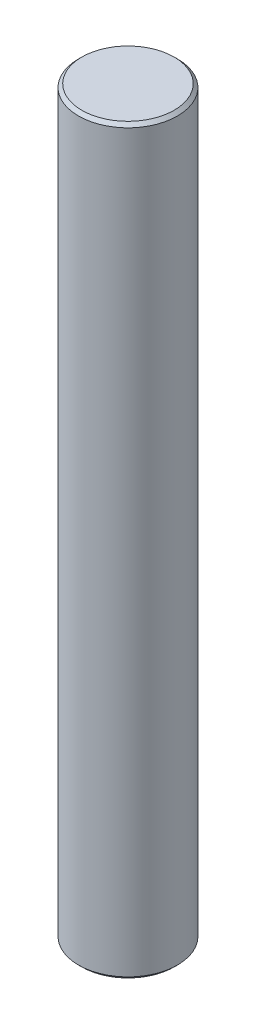
ISO-10303-21;
HEADER;
FILE_DESCRIPTION(('STEP AP214'),'2;1');
FILE_NAME('part.step','',(''),(''),'','','');
FILE_SCHEMA(('AUTOMOTIVE_DESIGN { 1 0 10303 214 1 1 1 1 }'));
ENDSEC;
DATA;
#1=APPLICATION_CONTEXT('core data for automotive mechanical design processes');
#2=APPLICATION_PROTOCOL_DEFINITION('international standard','automotive_design',2000,#1);
#3=PRODUCT_CONTEXT('',#1,'mechanical');
#4=PRODUCT('Part','Part','',(#3));
#5=PRODUCT_RELATED_PRODUCT_CATEGORY('part','',(#4));
#6=PRODUCT_DEFINITION_FORMATION('','',#4);
#7=PRODUCT_DEFINITION_CONTEXT('part definition',#1,'design');
#8=PRODUCT_DEFINITION('design','',#6,#7);
#9=PRODUCT_DEFINITION_SHAPE('','',#8);
#10=(LENGTH_UNIT() NAMED_UNIT(*) SI_UNIT(.MILLI.,.METRE.));
#11=(NAMED_UNIT(*) PLANE_ANGLE_UNIT() SI_UNIT($,.RADIAN.));
#12=(NAMED_UNIT(*) SI_UNIT($,.STERADIAN.) SOLID_ANGLE_UNIT());
#13=UNCERTAINTY_MEASURE_WITH_UNIT(LENGTH_MEASURE(1.E-05),#10,'distance_accuracy_value','');
#14=(GEOMETRIC_REPRESENTATION_CONTEXT(3) GLOBAL_UNCERTAINTY_ASSIGNED_CONTEXT((#13)) GLOBAL_UNIT_ASSIGNED_CONTEXT((#10,
#11,#12)) REPRESENTATION_CONTEXT('',''));
#15=CARTESIAN_POINT('',(0.,0.,0.));
#16=DIRECTION('',(0.,0.,1.));
#17=DIRECTION('',(1.,0.,0.));
#18=AXIS2_PLACEMENT_3D('',#15,#16,#17);
#19=CARTESIAN_POINT('',(0.,-22.5,0.));
#20=DIRECTION('',(0.,1.,0.));
#21=DIRECTION('',(0.,0.,1.));
#22=AXIS2_PLACEMENT_3D('',#19,#20,#21);
#23=PLANE('',#22);
#24=CARTESIAN_POINT('',(0.,-22.5,0.));
#25=DIRECTION('',(0.,1.,0.));
#26=DIRECTION('',(0.,0.,1.));
#27=AXIS2_PLACEMENT_3D('',#24,#25,#26);
#28=CIRCLE('',#27,2.79999999999999);
#29=CARTESIAN_POINT('',(0.,-22.5,2.79999999999999));
#30=VERTEX_POINT('',#29);
#31=EDGE_CURVE('E38',#30,#30,#28,.F.);
#32=ORIENTED_EDGE('',*,*,#31,.T.);
#33=EDGE_LOOP('',(#32));
#34=FACE_BOUND('',#33,.T.);
#35=ADVANCED_FACE('F31',(#34),#23,.F.);
#36=CARTESIAN_POINT('',(0.,72.7085910652921,0.));
#37=DIRECTION('',(0.,1.,0.));
#38=DIRECTION('',(0.,0.,1.));
#39=AXIS2_PLACEMENT_3D('',#36,#37,#38);
#40=CYLINDRICAL_SURFACE('',#39,3.00000000000001);
#41=CARTESIAN_POINT('',(0.,-22.3,0.));
#42=DIRECTION('',(0.,1.,0.));
#43=DIRECTION('',(0.,0.,1.));
#44=AXIS2_PLACEMENT_3D('',#41,#42,#43);
#45=CIRCLE('',#44,3.00000000000001);
#46=CARTESIAN_POINT('',(0.,-22.3,3.00000000000001));
#47=VERTEX_POINT('',#46);
#48=EDGE_CURVE('E42',#47,#47,#45,.T.);
#49=ORIENTED_EDGE('',*,*,#48,.T.);
#50=EDGE_LOOP('',(#49));
#51=FACE_BOUND('',#50,.T.);
#52=CARTESIAN_POINT('',(0.,22.3,0.));
#53=DIRECTION('',(0.,-1.,0.));
#54=DIRECTION('',(0.,0.,-1.));
#55=AXIS2_PLACEMENT_3D('',#52,#53,#54);
#56=CIRCLE('',#55,3.00000000000001);
#57=CARTESIAN_POINT('',(0.,22.3,-3.00000000000001));
#58=VERTEX_POINT('',#57);
#59=EDGE_CURVE('E46',#58,#58,#56,.T.);
#60=ORIENTED_EDGE('',*,*,#59,.T.);
#61=EDGE_LOOP('',(#60));
#62=FACE_BOUND('',#61,.T.);
#63=ADVANCED_FACE('F52',(#51,#62),#40,.T.);
#64=CARTESIAN_POINT('',(0.,22.5,0.));
#65=DIRECTION('',(0.,-1.,0.));
#66=DIRECTION('',(0.,0.,-1.));
#67=AXIS2_PLACEMENT_3D('',#64,#65,#66);
#68=PLANE('',#67);
#69=CARTESIAN_POINT('',(0.,22.5,0.));
#70=DIRECTION('',(0.,-1.,0.));
#71=DIRECTION('',(0.,0.,-1.));
#72=AXIS2_PLACEMENT_3D('',#69,#70,#71);
#73=CIRCLE('',#72,2.80000000000001);
#74=CARTESIAN_POINT('',(0.,22.5,-2.80000000000001));
#75=VERTEX_POINT('',#74);
#76=EDGE_CURVE('E10',#75,#75,#73,.F.);
#77=ORIENTED_EDGE('',*,*,#76,.T.);
#78=EDGE_LOOP('',(#77));
#79=FACE_BOUND('',#78,.T.);
#80=ADVANCED_FACE('F60',(#79),#68,.F.);
#81=CARTESIAN_POINT('',(0.,-22.3,0.));
#82=DIRECTION('',(0.,1.,0.));
#83=DIRECTION('',(0.,0.,1.));
#84=AXIS2_PLACEMENT_3D('',#81,#82,#83);
#85=CONICAL_SURFACE('',#84,3.00000000000001,0.785398163397457);
#86=ORIENTED_EDGE('',*,*,#31,.F.);
#87=EDGE_LOOP('',(#86));
#88=FACE_BOUND('',#87,.T.);
#89=ORIENTED_EDGE('',*,*,#48,.F.);
#90=EDGE_LOOP('',(#89));
#91=FACE_BOUND('',#90,.T.);
#92=ADVANCED_FACE('F56',(#88,#91),#85,.T.);
#93=CARTESIAN_POINT('',(0.,22.5,0.));
#94=DIRECTION('',(0.,-1.,0.));
#95=DIRECTION('',(0.,0.,-1.));
#96=AXIS2_PLACEMENT_3D('',#93,#94,#95);
#97=CONICAL_SURFACE('',#96,2.80000000000001,0.785398163397448);
#98=ORIENTED_EDGE('',*,*,#59,.F.);
#99=EDGE_LOOP('',(#98));
#100=FACE_BOUND('',#99,.T.);
#101=ORIENTED_EDGE('',*,*,#76,.F.);
#102=EDGE_LOOP('',(#101));
#103=FACE_BOUND('',#102,.T.);
#104=ADVANCED_FACE('F33',(#100,#103),#97,.T.);
#105=CLOSED_SHELL('',(#35,#63,#80,#92,#104));
#106=MANIFOLD_SOLID_BREP('B2',#105);
#107=ADVANCED_BREP_SHAPE_REPRESENTATION('',(#18,#106),#14);
#108=SHAPE_DEFINITION_REPRESENTATION(#9,#107);
ENDSEC;
END-ISO-10303-21;
